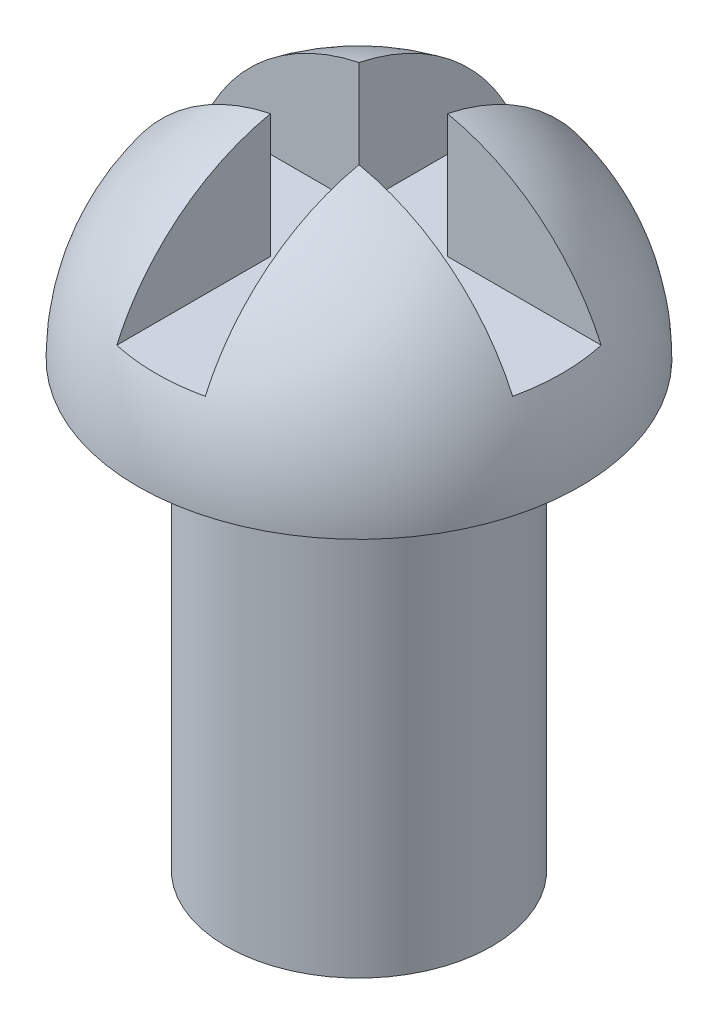
ISO-10303-21;
HEADER;
FILE_DESCRIPTION(('STEP AP214'),'2;1');
FILE_NAME('part.step','',(''),(''),'','','');
FILE_SCHEMA(('AUTOMOTIVE_DESIGN { 1 0 10303 214 1 1 1 1 }'));
ENDSEC;
DATA;
#1=APPLICATION_CONTEXT('core data for automotive mechanical design processes');
#2=APPLICATION_PROTOCOL_DEFINITION('international standard','automotive_design',2000,#1);
#3=PRODUCT_CONTEXT('',#1,'mechanical');
#4=PRODUCT('Part','Part','',(#3));
#5=PRODUCT_RELATED_PRODUCT_CATEGORY('part','',(#4));
#6=PRODUCT_DEFINITION_FORMATION('','',#4);
#7=PRODUCT_DEFINITION_CONTEXT('part definition',#1,'design');
#8=PRODUCT_DEFINITION('design','',#6,#7);
#9=PRODUCT_DEFINITION_SHAPE('','',#8);
#10=(LENGTH_UNIT() NAMED_UNIT(*) SI_UNIT(.MILLI.,.METRE.));
#11=(NAMED_UNIT(*) PLANE_ANGLE_UNIT() SI_UNIT($,.RADIAN.));
#12=(NAMED_UNIT(*) SI_UNIT($,.STERADIAN.) SOLID_ANGLE_UNIT());
#13=UNCERTAINTY_MEASURE_WITH_UNIT(LENGTH_MEASURE(1.E-05),#10,'distance_accuracy_value','');
#14=(GEOMETRIC_REPRESENTATION_CONTEXT(3) GLOBAL_UNCERTAINTY_ASSIGNED_CONTEXT((#13)) GLOBAL_UNIT_ASSIGNED_CONTEXT((#10,
#11,#12)) REPRESENTATION_CONTEXT('',''));
#15=CARTESIAN_POINT('',(0.,0.,0.));
#16=DIRECTION('',(0.,0.,1.));
#17=DIRECTION('',(1.,0.,0.));
#18=AXIS2_PLACEMENT_3D('',#15,#16,#17);
#19=CARTESIAN_POINT('',(0.,5.,0.));
#20=DIRECTION('',(0.,-1.,0.));
#21=DIRECTION('',(0.,0.,-1.));
#22=AXIS2_PLACEMENT_3D('',#19,#20,#21);
#23=CYLINDRICAL_SURFACE('',#22,1.5);
#24=CARTESIAN_POINT('',(0.,5.,0.));
#25=DIRECTION('',(0.,1.,0.));
#26=DIRECTION('',(0.,0.,1.));
#27=AXIS2_PLACEMENT_3D('',#24,#25,#26);
#28=CIRCLE('',#27,1.5);
#29=CARTESIAN_POINT('',(0.,5.,1.5));
#30=VERTEX_POINT('',#29);
#31=EDGE_CURVE('E162',#30,#30,#28,.T.);
#32=ORIENTED_EDGE('',*,*,#31,.F.);
#33=EDGE_LOOP('',(#32));
#34=FACE_BOUND('',#33,.T.);
#35=CARTESIAN_POINT('',(0.,0.,0.));
#36=DIRECTION('',(0.,1.,0.));
#37=DIRECTION('',(0.,0.,1.));
#38=AXIS2_PLACEMENT_3D('',#35,#36,#37);
#39=CIRCLE('',#38,1.5);
#40=CARTESIAN_POINT('',(0.,0.,1.5));
#41=VERTEX_POINT('',#40);
#42=EDGE_CURVE('E161',#41,#41,#39,.T.);
#43=ORIENTED_EDGE('',*,*,#42,.T.);
#44=EDGE_LOOP('',(#43));
#45=FACE_BOUND('',#44,.T.);
#46=ADVANCED_FACE('F39',(#34,#45),#23,.T.);
#47=CARTESIAN_POINT('',(0.,0.,0.));
#48=DIRECTION('',(0.,1.,0.));
#49=DIRECTION('',(0.,0.,1.));
#50=AXIS2_PLACEMENT_3D('',#47,#48,#49);
#51=PLANE('',#50);
#52=ORIENTED_EDGE('',*,*,#42,.F.);
#53=EDGE_LOOP('',(#52));
#54=FACE_BOUND('',#53,.T.);
#55=ADVANCED_FACE('F221',(#54),#51,.F.);
#56=CARTESIAN_POINT('',(0.,5.,0.));
#57=DIRECTION('',(0.,0.,-1.));
#58=DIRECTION('',(-1.,0.,0.));
#59=AXIS2_PLACEMENT_3D('',#56,#57,#58);
#60=SPHERICAL_SURFACE('',#59,2.5);
#61=CARTESIAN_POINT('',(0.,5.,-0.5));
#62=DIRECTION('',(0.,0.,-1.));
#63=DIRECTION('',(-1.,0.,0.));
#64=AXIS2_PLACEMENT_3D('',#61,#62,#63);
#65=CIRCLE('',#64,2.44948974278318);
#66=CARTESIAN_POINT('',(-2.23606797749979,6.,-0.5));
#67=VERTEX_POINT('',#66);
#68=CARTESIAN_POINT('',(-0.5,7.39791576165636,-0.5));
#69=VERTEX_POINT('',#68);
#70=EDGE_CURVE('E47',#67,#69,#65,.T.);
#71=ORIENTED_EDGE('',*,*,#70,.T.);
#72=CARTESIAN_POINT('',(-0.5,5.,0.));
#73=DIRECTION('',(-1.,0.,0.));
#74=DIRECTION('',(0.,0.,1.));
#75=AXIS2_PLACEMENT_3D('',#72,#73,#74);
#76=CIRCLE('',#75,2.44948974278318);
#77=CARTESIAN_POINT('',(-0.5,6.,-2.23606797749979));
#78=VERTEX_POINT('',#77);
#79=EDGE_CURVE('E11',#69,#78,#76,.T.);
#80=ORIENTED_EDGE('',*,*,#79,.T.);
#81=CARTESIAN_POINT('',(0.,6.,0.));
#82=DIRECTION('',(0.,1.,0.));
#83=DIRECTION('',(0.,0.,1.));
#84=AXIS2_PLACEMENT_3D('',#81,#82,#83);
#85=CIRCLE('',#84,2.29128784747792);
#86=CARTESIAN_POINT('',(0.5,6.,-2.23606797749979));
#87=VERTEX_POINT('',#86);
#88=EDGE_CURVE('E113',#87,#78,#85,.T.);
#89=ORIENTED_EDGE('',*,*,#88,.F.);
#90=CARTESIAN_POINT('',(0.5,5.,0.));
#91=DIRECTION('',(1.,0.,0.));
#92=DIRECTION('',(0.,0.,-1.));
#93=AXIS2_PLACEMENT_3D('',#90,#91,#92);
#94=CIRCLE('',#93,2.44948974278318);
#95=CARTESIAN_POINT('',(0.5,7.39791576165636,-0.5));
#96=VERTEX_POINT('',#95);
#97=EDGE_CURVE('E191',#87,#96,#94,.T.);
#98=ORIENTED_EDGE('',*,*,#97,.T.);
#99=CARTESIAN_POINT('',(0.,5.,-0.5));
#100=DIRECTION('',(0.,0.,-1.));
#101=DIRECTION('',(-1.,0.,0.));
#102=AXIS2_PLACEMENT_3D('',#99,#100,#101);
#103=CIRCLE('',#102,2.44948974278318);
#104=CARTESIAN_POINT('',(2.23606797749979,6.,-0.5));
#105=VERTEX_POINT('',#104);
#106=EDGE_CURVE('E62',#96,#105,#103,.T.);
#107=ORIENTED_EDGE('',*,*,#106,.T.);
#108=CARTESIAN_POINT('',(2.23606797749979,6.,0.5));
#109=VERTEX_POINT('',#108);
#110=EDGE_CURVE('E173',#109,#105,#85,.T.);
#111=ORIENTED_EDGE('',*,*,#110,.F.);
#112=CARTESIAN_POINT('',(0.,5.,0.5));
#113=DIRECTION('',(0.,0.,1.));
#114=DIRECTION('',(1.,0.,0.));
#115=AXIS2_PLACEMENT_3D('',#112,#113,#114);
#116=CIRCLE('',#115,2.44948974278318);
#117=CARTESIAN_POINT('',(0.5,7.39791576165636,0.5));
#118=VERTEX_POINT('',#117);
#119=EDGE_CURVE('E181',#109,#118,#116,.T.);
#120=ORIENTED_EDGE('',*,*,#119,.T.);
#121=CARTESIAN_POINT('',(0.5,5.,0.));
#122=DIRECTION('',(1.,0.,0.));
#123=DIRECTION('',(0.,0.,-1.));
#124=AXIS2_PLACEMENT_3D('',#121,#122,#123);
#125=CIRCLE('',#124,2.44948974278318);
#126=CARTESIAN_POINT('',(0.5,6.,2.23606797749979));
#127=VERTEX_POINT('',#126);
#128=EDGE_CURVE('E177',#118,#127,#125,.T.);
#129=ORIENTED_EDGE('',*,*,#128,.T.);
#130=CARTESIAN_POINT('',(-0.5,6.,2.23606797749979));
#131=VERTEX_POINT('',#130);
#132=EDGE_CURVE('E166',#131,#127,#85,.T.);
#133=ORIENTED_EDGE('',*,*,#132,.F.);
#134=CARTESIAN_POINT('',(-0.5,5.,0.));
#135=DIRECTION('',(-1.,0.,0.));
#136=DIRECTION('',(0.,0.,1.));
#137=AXIS2_PLACEMENT_3D('',#134,#135,#136);
#138=CIRCLE('',#137,2.44948974278318);
#139=CARTESIAN_POINT('',(-0.5,7.39791576165636,0.5));
#140=VERTEX_POINT('',#139);
#141=EDGE_CURVE('E172',#131,#140,#138,.T.);
#142=ORIENTED_EDGE('',*,*,#141,.T.);
#143=CARTESIAN_POINT('',(0.,5.,0.5));
#144=DIRECTION('',(0.,0.,1.));
#145=DIRECTION('',(1.,0.,0.));
#146=AXIS2_PLACEMENT_3D('',#143,#144,#145);
#147=CIRCLE('',#146,2.44948974278318);
#148=CARTESIAN_POINT('',(-2.23606797749979,6.,0.5));
#149=VERTEX_POINT('',#148);
#150=EDGE_CURVE('E185',#140,#149,#147,.T.);
#151=ORIENTED_EDGE('',*,*,#150,.T.);
#152=EDGE_CURVE('E194',#67,#149,#85,.T.);
#153=ORIENTED_EDGE('',*,*,#152,.F.);
#154=EDGE_LOOP('',(#71,#80,#89,#98,#107,#111,#120,#129,#133,#142,#151,#153));
#155=FACE_BOUND('',#154,.T.);
#156=CARTESIAN_POINT('',(0.,5.,0.));
#157=DIRECTION('',(0.,-1.,0.));
#158=DIRECTION('',(0.,0.,1.));
#159=AXIS2_PLACEMENT_3D('',#156,#157,#158);
#160=CIRCLE('',#159,2.5);
#161=CARTESIAN_POINT('',(0.,5.,2.5));
#162=VERTEX_POINT('',#161);
#163=EDGE_CURVE('E150',#162,#162,#160,.T.);
#164=ORIENTED_EDGE('',*,*,#163,.F.);
#165=EDGE_LOOP('',(#164));
#166=FACE_BOUND('',#165,.T.);
#167=ADVANCED_FACE('F205',(#155,#166),#60,.T.);
#168=CARTESIAN_POINT('',(0.,5.,0.));
#169=DIRECTION('',(0.,-1.,0.));
#170=DIRECTION('',(0.,0.,1.));
#171=AXIS2_PLACEMENT_3D('',#168,#169,#170);
#172=PLANE('',#171);
#173=ORIENTED_EDGE('',*,*,#31,.T.);
#174=EDGE_LOOP('',(#173));
#175=FACE_BOUND('',#174,.T.);
#176=ORIENTED_EDGE('',*,*,#163,.T.);
#177=EDGE_LOOP('',(#176));
#178=FACE_BOUND('',#177,.T.);
#179=ADVANCED_FACE('F217',(#175,#178),#172,.T.);
#180=CARTESIAN_POINT('',(-0.5,6.,-2.87144541681283));
#181=DIRECTION('',(-1.,0.,0.));
#182=DIRECTION('',(0.,0.,1.));
#183=AXIS2_PLACEMENT_3D('',#180,#181,#182);
#184=PLANE('',#183);
#185=DIRECTION('',(0.,1.,0.));
#186=VECTOR('',#185,1.);
#187=CARTESIAN_POINT('',(-0.5,6.,-0.5));
#188=LINE('',#187,#186);
#189=CARTESIAN_POINT('',(-0.5,6.,-0.5));
#190=VERTEX_POINT('',#189);
#191=EDGE_CURVE('E118',#190,#69,#188,.T.);
#192=ORIENTED_EDGE('',*,*,#191,.F.);
#193=DIRECTION('',(0.,0.,1.));
#194=VECTOR('',#193,1.);
#195=CARTESIAN_POINT('',(-0.5,6.,-2.87144541681283));
#196=LINE('',#195,#194);
#197=EDGE_CURVE('E105',#78,#190,#196,.T.);
#198=ORIENTED_EDGE('',*,*,#197,.F.);
#199=ORIENTED_EDGE('',*,*,#79,.F.);
#200=EDGE_LOOP('',(#192,#198,#199));
#201=FACE_BOUND('',#200,.T.);
#202=ADVANCED_FACE('F119',(#201),#184,.F.);
#203=CARTESIAN_POINT('',(0.5,6.,-2.87144541681283));
#204=DIRECTION('',(1.,0.,0.));
#205=DIRECTION('',(0.,0.,-1.));
#206=AXIS2_PLACEMENT_3D('',#203,#204,#205);
#207=PLANE('',#206);
#208=DIRECTION('',(0.,0.,-1.));
#209=VECTOR('',#208,1.);
#210=CARTESIAN_POINT('',(0.5,6.,-2.87144541681283));
#211=LINE('',#210,#209);
#212=CARTESIAN_POINT('',(0.5,6.,-0.5));
#213=VERTEX_POINT('',#212);
#214=EDGE_CURVE('E124',#213,#87,#211,.T.);
#215=ORIENTED_EDGE('',*,*,#214,.F.);
#216=DIRECTION('',(0.,1.,0.));
#217=VECTOR('',#216,1.);
#218=CARTESIAN_POINT('',(0.5,6.,-0.5));
#219=LINE('',#218,#217);
#220=EDGE_CURVE('E147',#213,#96,#219,.T.);
#221=ORIENTED_EDGE('',*,*,#220,.T.);
#222=ORIENTED_EDGE('',*,*,#97,.F.);
#223=EDGE_LOOP('',(#215,#221,#222));
#224=FACE_BOUND('',#223,.T.);
#225=ADVANCED_FACE('F208',(#224),#207,.F.);
#226=CARTESIAN_POINT('',(0.5,6.,-0.5));
#227=DIRECTION('',(0.,0.,-1.));
#228=DIRECTION('',(-1.,0.,0.));
#229=AXIS2_PLACEMENT_3D('',#226,#227,#228);
#230=PLANE('',#229);
#231=ORIENTED_EDGE('',*,*,#220,.F.);
#232=DIRECTION('',(-1.,0.,0.));
#233=VECTOR('',#232,1.);
#234=CARTESIAN_POINT('',(0.5,6.,-0.5));
#235=LINE('',#234,#233);
#236=EDGE_CURVE('E142',#105,#213,#235,.T.);
#237=ORIENTED_EDGE('',*,*,#236,.F.);
#238=ORIENTED_EDGE('',*,*,#106,.F.);
#239=EDGE_LOOP('',(#231,#237,#238));
#240=FACE_BOUND('',#239,.T.);
#241=ADVANCED_FACE('F203',(#240),#230,.F.);
#242=CARTESIAN_POINT('',(0.5,6.,0.5));
#243=DIRECTION('',(0.,0.,1.));
#244=DIRECTION('',(1.,0.,0.));
#245=AXIS2_PLACEMENT_3D('',#242,#243,#244);
#246=PLANE('',#245);
#247=DIRECTION('',(1.,0.,0.));
#248=VECTOR('',#247,1.);
#249=CARTESIAN_POINT('',(0.5,6.,0.5));
#250=LINE('',#249,#248);
#251=CARTESIAN_POINT('',(0.5,6.,0.5));
#252=VERTEX_POINT('',#251);
#253=EDGE_CURVE('E138',#252,#109,#250,.T.);
#254=ORIENTED_EDGE('',*,*,#253,.F.);
#255=DIRECTION('',(0.,1.,0.));
#256=VECTOR('',#255,1.);
#257=CARTESIAN_POINT('',(0.5,6.,0.5));
#258=LINE('',#257,#256);
#259=EDGE_CURVE('E151',#252,#118,#258,.T.);
#260=ORIENTED_EDGE('',*,*,#259,.T.);
#261=ORIENTED_EDGE('',*,*,#119,.F.);
#262=EDGE_LOOP('',(#254,#260,#261));
#263=FACE_BOUND('',#262,.T.);
#264=ADVANCED_FACE('F215',(#263),#246,.F.);
#265=CARTESIAN_POINT('',(0.5,6.,0.5));
#266=DIRECTION('',(1.,0.,0.));
#267=DIRECTION('',(0.,0.,-1.));
#268=AXIS2_PLACEMENT_3D('',#265,#266,#267);
#269=PLANE('',#268);
#270=ORIENTED_EDGE('',*,*,#259,.F.);
#271=DIRECTION('',(0.,0.,-1.));
#272=VECTOR('',#271,1.);
#273=CARTESIAN_POINT('',(0.5,6.,0.5));
#274=LINE('',#273,#272);
#275=EDGE_CURVE('E135',#127,#252,#274,.T.);
#276=ORIENTED_EDGE('',*,*,#275,.F.);
#277=ORIENTED_EDGE('',*,*,#128,.F.);
#278=EDGE_LOOP('',(#270,#276,#277));
#279=FACE_BOUND('',#278,.T.);
#280=ADVANCED_FACE('F249',(#279),#269,.F.);
#281=CARTESIAN_POINT('',(-0.5,6.,0.5));
#282=DIRECTION('',(-1.,0.,0.));
#283=DIRECTION('',(0.,0.,1.));
#284=AXIS2_PLACEMENT_3D('',#281,#282,#283);
#285=PLANE('',#284);
#286=DIRECTION('',(0.,0.,1.));
#287=VECTOR('',#286,1.);
#288=CARTESIAN_POINT('',(-0.5,6.,0.5));
#289=LINE('',#288,#287);
#290=CARTESIAN_POINT('',(-0.5,6.,0.5));
#291=VERTEX_POINT('',#290);
#292=EDGE_CURVE('E54',#291,#131,#289,.T.);
#293=ORIENTED_EDGE('',*,*,#292,.F.);
#294=DIRECTION('',(0.,1.,0.));
#295=VECTOR('',#294,1.);
#296=CARTESIAN_POINT('',(-0.5,6.,0.5));
#297=LINE('',#296,#295);
#298=EDGE_CURVE('E123',#291,#140,#297,.T.);
#299=ORIENTED_EDGE('',*,*,#298,.T.);
#300=ORIENTED_EDGE('',*,*,#141,.F.);
#301=EDGE_LOOP('',(#293,#299,#300));
#302=FACE_BOUND('',#301,.T.);
#303=ADVANCED_FACE('F245',(#302),#285,.F.);
#304=CARTESIAN_POINT('',(-3.04925326467535,6.,0.5));
#305=DIRECTION('',(0.,0.,1.));
#306=DIRECTION('',(1.,0.,0.));
#307=AXIS2_PLACEMENT_3D('',#304,#305,#306);
#308=PLANE('',#307);
#309=ORIENTED_EDGE('',*,*,#298,.F.);
#310=DIRECTION('',(1.,0.,0.));
#311=VECTOR('',#310,1.);
#312=CARTESIAN_POINT('',(-3.04925326467535,6.,0.5));
#313=LINE('',#312,#311);
#314=EDGE_CURVE('E128',#149,#291,#313,.T.);
#315=ORIENTED_EDGE('',*,*,#314,.F.);
#316=ORIENTED_EDGE('',*,*,#150,.F.);
#317=EDGE_LOOP('',(#309,#315,#316));
#318=FACE_BOUND('',#317,.T.);
#319=ADVANCED_FACE('F242',(#318),#308,.F.);
#320=CARTESIAN_POINT('',(-3.04925326467535,6.,-0.5));
#321=DIRECTION('',(0.,0.,-1.));
#322=DIRECTION('',(-1.,0.,0.));
#323=AXIS2_PLACEMENT_3D('',#320,#321,#322);
#324=PLANE('',#323);
#325=DIRECTION('',(-1.,0.,0.));
#326=VECTOR('',#325,1.);
#327=CARTESIAN_POINT('',(-3.04925326467535,6.,-0.5));
#328=LINE('',#327,#326);
#329=EDGE_CURVE('E109',#190,#67,#328,.T.);
#330=ORIENTED_EDGE('',*,*,#329,.F.);
#331=ORIENTED_EDGE('',*,*,#191,.T.);
#332=ORIENTED_EDGE('',*,*,#70,.F.);
#333=EDGE_LOOP('',(#330,#331,#332));
#334=FACE_BOUND('',#333,.T.);
#335=ADVANCED_FACE('F126',(#334),#324,.F.);
#336=CARTESIAN_POINT('',(0.,6.,0.));
#337=DIRECTION('',(0.,1.,0.));
#338=DIRECTION('',(0.,0.,1.));
#339=AXIS2_PLACEMENT_3D('',#336,#337,#338);
#340=PLANE('',#339);
#341=ORIENTED_EDGE('',*,*,#110,.T.);
#342=ORIENTED_EDGE('',*,*,#236,.T.);
#343=ORIENTED_EDGE('',*,*,#214,.T.);
#344=ORIENTED_EDGE('',*,*,#88,.T.);
#345=ORIENTED_EDGE('',*,*,#197,.T.);
#346=ORIENTED_EDGE('',*,*,#329,.T.);
#347=ORIENTED_EDGE('',*,*,#152,.T.);
#348=ORIENTED_EDGE('',*,*,#314,.T.);
#349=ORIENTED_EDGE('',*,*,#292,.T.);
#350=ORIENTED_EDGE('',*,*,#132,.T.);
#351=ORIENTED_EDGE('',*,*,#275,.T.);
#352=ORIENTED_EDGE('',*,*,#253,.T.);
#353=EDGE_LOOP('',(#341,#342,#343,#344,#345,#346,#347,#348,#349,#350,#351,#352));
#354=FACE_BOUND('',#353,.T.);
#355=ADVANCED_FACE('F107',(#354),#340,.T.);
#356=CLOSED_SHELL('',(#46,#55,#167,#179,#202,#225,#241,#264,#280,#303,#319,#335,#355));
#357=MANIFOLD_SOLID_BREP('B2',#356);
#358=ADVANCED_BREP_SHAPE_REPRESENTATION('',(#18,#357),#14);
#359=SHAPE_DEFINITION_REPRESENTATION(#9,#358);
ENDSEC;
END-ISO-10303-21;
